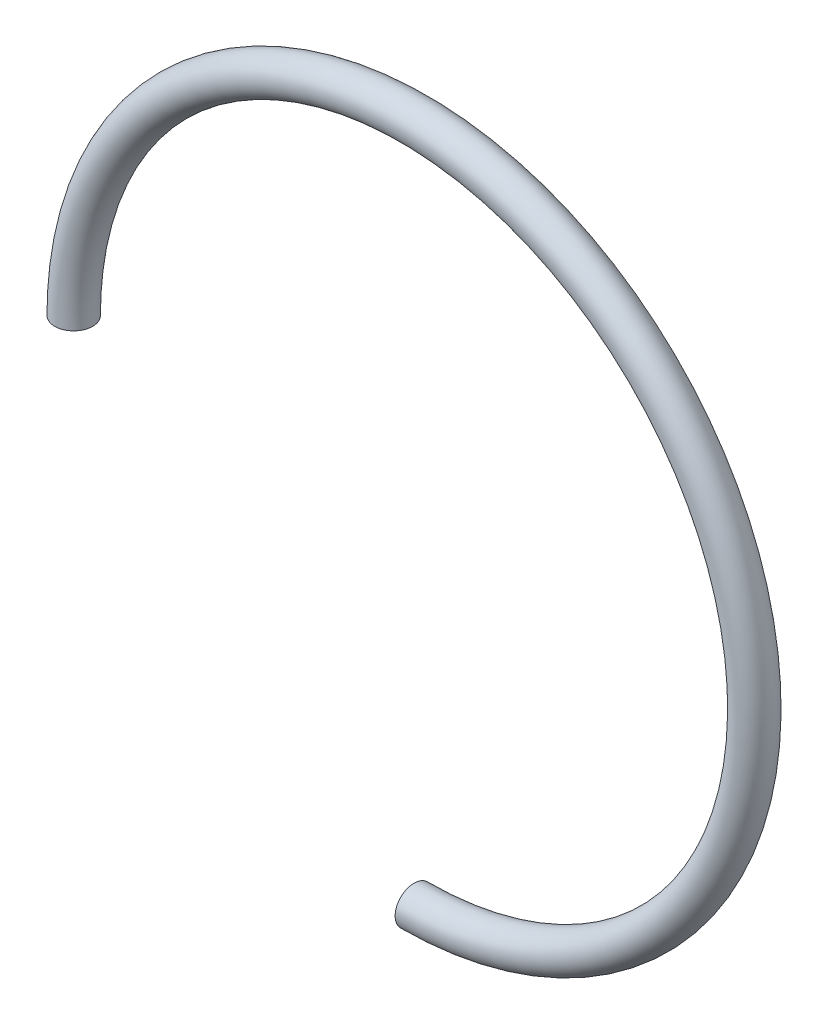
ISO-10303-21;
HEADER;
FILE_DESCRIPTION(('STEP AP214'),'2;1');
FILE_NAME('part.step','',(''),(''),'','','');
FILE_SCHEMA(('AUTOMOTIVE_DESIGN { 1 0 10303 214 1 1 1 1 }'));
ENDSEC;
DATA;
#1=APPLICATION_CONTEXT('core data for automotive mechanical design processes');
#2=APPLICATION_PROTOCOL_DEFINITION('international standard','automotive_design',2000,#1);
#3=PRODUCT_CONTEXT('',#1,'mechanical');
#4=PRODUCT('Part','Part','',(#3));
#5=PRODUCT_RELATED_PRODUCT_CATEGORY('part','',(#4));
#6=PRODUCT_DEFINITION_FORMATION('','',#4);
#7=PRODUCT_DEFINITION_CONTEXT('part definition',#1,'design');
#8=PRODUCT_DEFINITION('design','',#6,#7);
#9=PRODUCT_DEFINITION_SHAPE('','',#8);
#10=(LENGTH_UNIT() NAMED_UNIT(*) SI_UNIT(.MILLI.,.METRE.));
#11=(NAMED_UNIT(*) PLANE_ANGLE_UNIT() SI_UNIT($,.RADIAN.));
#12=(NAMED_UNIT(*) SI_UNIT($,.STERADIAN.) SOLID_ANGLE_UNIT());
#13=UNCERTAINTY_MEASURE_WITH_UNIT(LENGTH_MEASURE(1.E-05),#10,'distance_accuracy_value','');
#14=(GEOMETRIC_REPRESENTATION_CONTEXT(3) GLOBAL_UNCERTAINTY_ASSIGNED_CONTEXT((#13)) GLOBAL_UNIT_ASSIGNED_CONTEXT((#10,
#11,#12)) REPRESENTATION_CONTEXT('',''));
#15=CARTESIAN_POINT('',(0.,0.,0.));
#16=DIRECTION('',(0.,0.,1.));
#17=DIRECTION('',(1.,0.,0.));
#18=AXIS2_PLACEMENT_3D('',#15,#16,#17);
#19=CARTESIAN_POINT('',(0.,-4.5,0.));
#20=DIRECTION('',(1.,0.,0.));
#21=DIRECTION('',(0.,1.,0.));
#22=AXIS2_PLACEMENT_3D('',#19,#20,#21);
#23=PLANE('',#22);
#24=CARTESIAN_POINT('',(0.,-4.5,0.));
#25=DIRECTION('',(1.,0.,0.));
#26=DIRECTION('',(0.,1.,0.));
#27=AXIS2_PLACEMENT_3D('',#24,#25,#26);
#28=CIRCLE('',#27,0.25);
#29=CARTESIAN_POINT('',(0.,-4.25,0.));
#30=VERTEX_POINT('',#29);
#31=EDGE_CURVE('E61',#30,#30,#28,.T.);
#32=ORIENTED_EDGE('',*,*,#31,.F.);
#33=EDGE_LOOP('',(#32));
#34=FACE_BOUND('',#33,.T.);
#35=ADVANCED_FACE('F54',(#34),#23,.F.);
#36=CARTESIAN_POINT('',(-4.5,0.,0.));
#37=DIRECTION('',(0.,-1.,0.));
#38=DIRECTION('',(1.,0.,0.));
#39=AXIS2_PLACEMENT_3D('',#36,#37,#38);
#40=PLANE('',#39);
#41=CARTESIAN_POINT('',(-4.5,0.,0.));
#42=DIRECTION('',(0.,-1.,0.));
#43=DIRECTION('',(1.,0.,0.));
#44=AXIS2_PLACEMENT_3D('',#41,#42,#43);
#45=CIRCLE('',#44,0.25);
#46=CARTESIAN_POINT('',(-4.25,0.,0.));
#47=VERTEX_POINT('',#46);
#48=EDGE_CURVE('E14',#47,#47,#45,.T.);
#49=ORIENTED_EDGE('',*,*,#48,.T.);
#50=EDGE_LOOP('',(#49));
#51=FACE_BOUND('',#50,.T.);
#52=ADVANCED_FACE('F68',(#51),#40,.T.);
#53=CARTESIAN_POINT('',(0.,0.,0.));
#54=DIRECTION('',(0.,0.,1.));
#55=DIRECTION('',(1.,0.,0.));
#56=AXIS2_PLACEMENT_3D('',#53,#54,#55);
#57=TOROIDAL_SURFACE('',#56,4.5,0.25);
#58=ORIENTED_EDGE('',*,*,#48,.F.);
#59=EDGE_LOOP('',(#58));
#60=FACE_BOUND('',#59,.T.);
#61=ORIENTED_EDGE('',*,*,#31,.T.);
#62=EDGE_LOOP('',(#61));
#63=FACE_BOUND('',#62,.T.);
#64=ADVANCED_FACE('F70',(#60,#63),#57,.T.);
#65=CLOSED_SHELL('',(#35,#52,#64));
#66=MANIFOLD_SOLID_BREP('B2',#65);
#67=ADVANCED_BREP_SHAPE_REPRESENTATION('',(#18,#66),#14);
#68=SHAPE_DEFINITION_REPRESENTATION(#9,#67);
ENDSEC;
END-ISO-10303-21;
